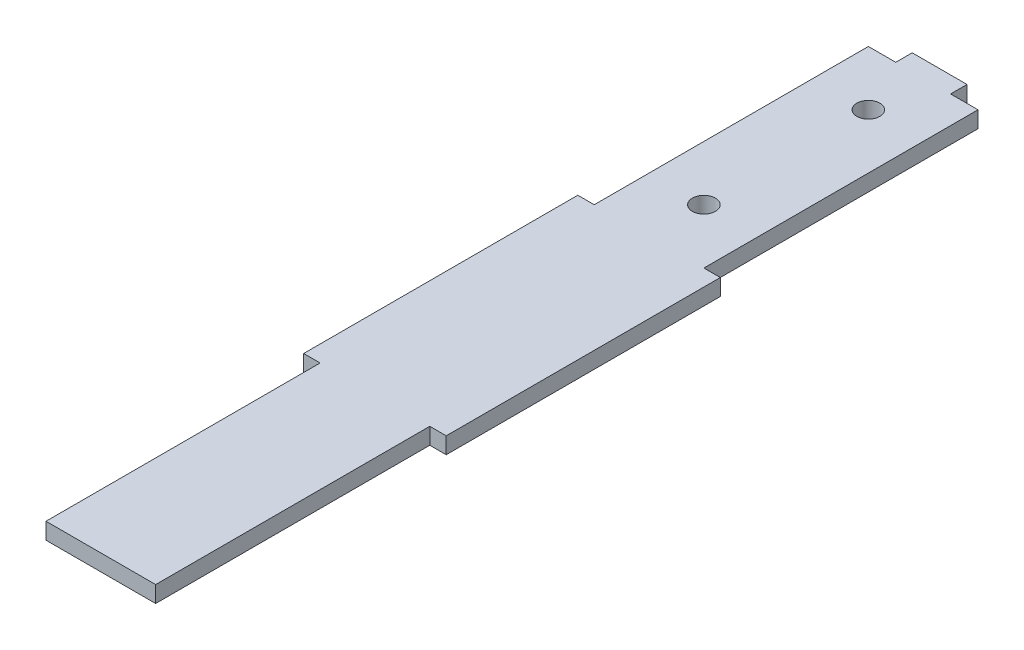
ISO-10303-21;
HEADER;
FILE_DESCRIPTION(('STEP AP214'),'2;1');
FILE_NAME('part.step','',(''),(''),'','','');
FILE_SCHEMA(('AUTOMOTIVE_DESIGN { 1 0 10303 214 1 1 1 1 }'));
ENDSEC;
DATA;
#1=APPLICATION_CONTEXT('core data for automotive mechanical design processes');
#2=APPLICATION_PROTOCOL_DEFINITION('international standard','automotive_design',2000,#1);
#3=PRODUCT_CONTEXT('',#1,'mechanical');
#4=PRODUCT('Part','Part','',(#3));
#5=PRODUCT_RELATED_PRODUCT_CATEGORY('part','',(#4));
#6=PRODUCT_DEFINITION_FORMATION('','',#4);
#7=PRODUCT_DEFINITION_CONTEXT('part definition',#1,'design');
#8=PRODUCT_DEFINITION('design','',#6,#7);
#9=PRODUCT_DEFINITION_SHAPE('','',#8);
#10=(LENGTH_UNIT() NAMED_UNIT(*) SI_UNIT(.MILLI.,.METRE.));
#11=(NAMED_UNIT(*) PLANE_ANGLE_UNIT() SI_UNIT($,.RADIAN.));
#12=(NAMED_UNIT(*) SI_UNIT($,.STERADIAN.) SOLID_ANGLE_UNIT());
#13=UNCERTAINTY_MEASURE_WITH_UNIT(LENGTH_MEASURE(1.E-05),#10,'distance_accuracy_value','');
#14=(GEOMETRIC_REPRESENTATION_CONTEXT(3) GLOBAL_UNCERTAINTY_ASSIGNED_CONTEXT((#13)) GLOBAL_UNIT_ASSIGNED_CONTEXT((#10,
#11,#12)) REPRESENTATION_CONTEXT('',''));
#15=CARTESIAN_POINT('',(0.,0.,0.));
#16=DIRECTION('',(0.,0.,1.));
#17=DIRECTION('',(1.,0.,0.));
#18=AXIS2_PLACEMENT_3D('',#15,#16,#17);
#19=CARTESIAN_POINT('',(0.,3.,0.));
#20=DIRECTION('',(1.,0.,0.));
#21=DIRECTION('',(0.,0.,-1.));
#22=AXIS2_PLACEMENT_3D('',#19,#20,#21);
#23=PLANE('',#22);
#24=DIRECTION('',(0.,0.,1.));
#25=VECTOR('',#24,1.);
#26=CARTESIAN_POINT('',(0.,0.,0.));
#27=LINE('',#26,#25);
#28=CARTESIAN_POINT('',(0.,0.,0.));
#29=VERTEX_POINT('',#28);
#30=CARTESIAN_POINT('',(0.,0.,50.));
#31=VERTEX_POINT('',#30);
#32=EDGE_CURVE('E179',#29,#31,#27,.T.);
#33=ORIENTED_EDGE('',*,*,#32,.T.);
#34=DIRECTION('',(0.,-1.,0.));
#35=VECTOR('',#34,1.);
#36=CARTESIAN_POINT('',(0.,3.,50.));
#37=LINE('',#36,#35);
#38=CARTESIAN_POINT('',(0.,3.,50.));
#39=VERTEX_POINT('',#38);
#40=EDGE_CURVE('E11',#39,#31,#37,.T.);
#41=ORIENTED_EDGE('',*,*,#40,.F.);
#42=DIRECTION('',(0.,0.,1.));
#43=VECTOR('',#42,1.);
#44=CARTESIAN_POINT('',(0.,3.,0.));
#45=LINE('',#44,#43);
#46=CARTESIAN_POINT('',(0.,3.,0.));
#47=VERTEX_POINT('',#46);
#48=EDGE_CURVE('E210',#47,#39,#45,.T.);
#49=ORIENTED_EDGE('',*,*,#48,.F.);
#50=DIRECTION('',(0.,-1.,0.));
#51=VECTOR('',#50,1.);
#52=CARTESIAN_POINT('',(0.,3.,0.));
#53=LINE('',#52,#51);
#54=EDGE_CURVE('E175',#47,#29,#53,.T.);
#55=ORIENTED_EDGE('',*,*,#54,.T.);
#56=EDGE_LOOP('',(#33,#41,#49,#55));
#57=FACE_BOUND('',#56,.T.);
#58=ADVANCED_FACE('F35',(#57),#23,.F.);
#59=CARTESIAN_POINT('',(0.,3.,50.));
#60=DIRECTION('',(0.,0.,1.));
#61=DIRECTION('',(1.,0.,0.));
#62=AXIS2_PLACEMENT_3D('',#59,#60,#61);
#63=PLANE('',#62);
#64=DIRECTION('',(-1.,0.,0.));
#65=VECTOR('',#64,1.);
#66=CARTESIAN_POINT('',(0.,0.,50.));
#67=LINE('',#66,#65);
#68=CARTESIAN_POINT('',(-3.,0.,50.));
#69=VERTEX_POINT('',#68);
#70=EDGE_CURVE('E182',#31,#69,#67,.T.);
#71=ORIENTED_EDGE('',*,*,#70,.T.);
#72=DIRECTION('',(0.,-1.,0.));
#73=VECTOR('',#72,1.);
#74=CARTESIAN_POINT('',(-3.,3.,50.));
#75=LINE('',#74,#73);
#76=CARTESIAN_POINT('',(-3.,3.,50.));
#77=VERTEX_POINT('',#76);
#78=EDGE_CURVE('E43',#77,#69,#75,.T.);
#79=ORIENTED_EDGE('',*,*,#78,.F.);
#80=DIRECTION('',(-1.,0.,0.));
#81=VECTOR('',#80,1.);
#82=CARTESIAN_POINT('',(0.,3.,50.));
#83=LINE('',#82,#81);
#84=EDGE_CURVE('E118',#39,#77,#83,.T.);
#85=ORIENTED_EDGE('',*,*,#84,.F.);
#86=ORIENTED_EDGE('',*,*,#40,.T.);
#87=EDGE_LOOP('',(#71,#79,#85,#86));
#88=FACE_BOUND('',#87,.T.);
#89=ADVANCED_FACE('F310',(#88),#63,.F.);
#90=CARTESIAN_POINT('',(-3.,3.,50.));
#91=DIRECTION('',(1.,0.,0.));
#92=DIRECTION('',(0.,0.,-1.));
#93=AXIS2_PLACEMENT_3D('',#90,#91,#92);
#94=PLANE('',#93);
#95=DIRECTION('',(0.,0.,1.));
#96=VECTOR('',#95,1.);
#97=CARTESIAN_POINT('',(-3.,0.,50.));
#98=LINE('',#97,#96);
#99=CARTESIAN_POINT('',(-2.99999999999999,0.,100.));
#100=VERTEX_POINT('',#99);
#101=EDGE_CURVE('E185',#69,#100,#98,.T.);
#102=ORIENTED_EDGE('',*,*,#101,.T.);
#103=DIRECTION('',(0.,-1.,0.));
#104=VECTOR('',#103,1.);
#105=CARTESIAN_POINT('',(-2.99999999999999,3.,100.));
#106=LINE('',#105,#104);
#107=CARTESIAN_POINT('',(-2.99999999999999,3.,100.));
#108=VERTEX_POINT('',#107);
#109=EDGE_CURVE('E241',#108,#100,#106,.T.);
#110=ORIENTED_EDGE('',*,*,#109,.F.);
#111=DIRECTION('',(0.,0.,1.));
#112=VECTOR('',#111,1.);
#113=CARTESIAN_POINT('',(-3.,3.,50.));
#114=LINE('',#113,#112);
#115=EDGE_CURVE('E249',#77,#108,#114,.T.);
#116=ORIENTED_EDGE('',*,*,#115,.F.);
#117=ORIENTED_EDGE('',*,*,#78,.T.);
#118=EDGE_LOOP('',(#102,#110,#116,#117));
#119=FACE_BOUND('',#118,.T.);
#120=ADVANCED_FACE('F247',(#119),#94,.F.);
#121=CARTESIAN_POINT('',(0.,3.,100.));
#122=DIRECTION('',(0.,0.,-1.));
#123=DIRECTION('',(-1.,0.,0.));
#124=AXIS2_PLACEMENT_3D('',#121,#122,#123);
#125=PLANE('',#124);
#126=DIRECTION('',(1.,0.,0.));
#127=VECTOR('',#126,1.);
#128=CARTESIAN_POINT('',(0.,0.,100.));
#129=LINE('',#128,#127);
#130=CARTESIAN_POINT('',(0.,0.,100.));
#131=VERTEX_POINT('',#130);
#132=EDGE_CURVE('E187',#100,#131,#129,.T.);
#133=ORIENTED_EDGE('',*,*,#132,.T.);
#134=DIRECTION('',(0.,-1.,0.));
#135=VECTOR('',#134,1.);
#136=CARTESIAN_POINT('',(0.,3.,100.));
#137=LINE('',#136,#135);
#138=CARTESIAN_POINT('',(0.,3.,100.));
#139=VERTEX_POINT('',#138);
#140=EDGE_CURVE('E238',#139,#131,#137,.T.);
#141=ORIENTED_EDGE('',*,*,#140,.F.);
#142=DIRECTION('',(1.,0.,0.));
#143=VECTOR('',#142,1.);
#144=CARTESIAN_POINT('',(0.,3.,100.));
#145=LINE('',#144,#143);
#146=EDGE_CURVE('E267',#108,#139,#145,.T.);
#147=ORIENTED_EDGE('',*,*,#146,.F.);
#148=ORIENTED_EDGE('',*,*,#109,.T.);
#149=EDGE_LOOP('',(#133,#141,#147,#148));
#150=FACE_BOUND('',#149,.T.);
#151=ADVANCED_FACE('F258',(#150),#125,.F.);
#152=CARTESIAN_POINT('',(0.,3.,100.));
#153=DIRECTION('',(1.,0.,0.));
#154=DIRECTION('',(0.,0.,-1.));
#155=AXIS2_PLACEMENT_3D('',#152,#153,#154);
#156=PLANE('',#155);
#157=DIRECTION('',(0.,0.,1.));
#158=VECTOR('',#157,1.);
#159=CARTESIAN_POINT('',(0.,0.,100.));
#160=LINE('',#159,#158);
#161=CARTESIAN_POINT('',(0.,0.,150.));
#162=VERTEX_POINT('',#161);
#163=EDGE_CURVE('E189',#131,#162,#160,.T.);
#164=ORIENTED_EDGE('',*,*,#163,.T.);
#165=DIRECTION('',(0.,-1.,0.));
#166=VECTOR('',#165,1.);
#167=CARTESIAN_POINT('',(0.,3.,150.));
#168=LINE('',#167,#166);
#169=CARTESIAN_POINT('',(0.,3.,150.));
#170=VERTEX_POINT('',#169);
#171=EDGE_CURVE('E235',#170,#162,#168,.T.);
#172=ORIENTED_EDGE('',*,*,#171,.F.);
#173=DIRECTION('',(0.,0.,1.));
#174=VECTOR('',#173,1.);
#175=CARTESIAN_POINT('',(0.,3.,100.));
#176=LINE('',#175,#174);
#177=EDGE_CURVE('E264',#139,#170,#176,.T.);
#178=ORIENTED_EDGE('',*,*,#177,.F.);
#179=ORIENTED_EDGE('',*,*,#140,.T.);
#180=EDGE_LOOP('',(#164,#172,#178,#179));
#181=FACE_BOUND('',#180,.T.);
#182=ADVANCED_FACE('F262',(#181),#156,.F.);
#183=CARTESIAN_POINT('',(0.,3.,150.));
#184=DIRECTION('',(0.,0.,-1.));
#185=DIRECTION('',(-1.,0.,0.));
#186=AXIS2_PLACEMENT_3D('',#183,#184,#185);
#187=PLANE('',#186);
#188=DIRECTION('',(1.,0.,0.));
#189=VECTOR('',#188,1.);
#190=CARTESIAN_POINT('',(0.,0.,150.));
#191=LINE('',#190,#189);
#192=CARTESIAN_POINT('',(20.,0.,150.));
#193=VERTEX_POINT('',#192);
#194=EDGE_CURVE('E191',#162,#193,#191,.T.);
#195=ORIENTED_EDGE('',*,*,#194,.T.);
#196=DIRECTION('',(0.,-1.,0.));
#197=VECTOR('',#196,1.);
#198=CARTESIAN_POINT('',(20.,3.,150.));
#199=LINE('',#198,#197);
#200=CARTESIAN_POINT('',(20.,3.,150.));
#201=VERTEX_POINT('',#200);
#202=EDGE_CURVE('E232',#201,#193,#199,.T.);
#203=ORIENTED_EDGE('',*,*,#202,.F.);
#204=DIRECTION('',(1.,0.,0.));
#205=VECTOR('',#204,1.);
#206=CARTESIAN_POINT('',(0.,3.,150.));
#207=LINE('',#206,#205);
#208=EDGE_CURVE('E266',#170,#201,#207,.T.);
#209=ORIENTED_EDGE('',*,*,#208,.F.);
#210=ORIENTED_EDGE('',*,*,#171,.T.);
#211=EDGE_LOOP('',(#195,#203,#209,#210));
#212=FACE_BOUND('',#211,.T.);
#213=ADVANCED_FACE('F323',(#212),#187,.F.);
#214=CARTESIAN_POINT('',(20.,3.,100.));
#215=DIRECTION('',(-1.,0.,0.));
#216=DIRECTION('',(0.,0.,1.));
#217=AXIS2_PLACEMENT_3D('',#214,#215,#216);
#218=PLANE('',#217);
#219=DIRECTION('',(0.,0.,-1.));
#220=VECTOR('',#219,1.);
#221=CARTESIAN_POINT('',(20.,0.,100.));
#222=LINE('',#221,#220);
#223=CARTESIAN_POINT('',(20.,0.,100.));
#224=VERTEX_POINT('',#223);
#225=EDGE_CURVE('E193',#193,#224,#222,.T.);
#226=ORIENTED_EDGE('',*,*,#225,.T.);
#227=DIRECTION('',(0.,-1.,0.));
#228=VECTOR('',#227,1.);
#229=CARTESIAN_POINT('',(20.,3.,100.));
#230=LINE('',#229,#228);
#231=CARTESIAN_POINT('',(20.,3.,100.));
#232=VERTEX_POINT('',#231);
#233=EDGE_CURVE('E229',#232,#224,#230,.T.);
#234=ORIENTED_EDGE('',*,*,#233,.F.);
#235=DIRECTION('',(0.,0.,-1.));
#236=VECTOR('',#235,1.);
#237=CARTESIAN_POINT('',(20.,3.,100.));
#238=LINE('',#237,#236);
#239=EDGE_CURVE('E269',#201,#232,#238,.T.);
#240=ORIENTED_EDGE('',*,*,#239,.F.);
#241=ORIENTED_EDGE('',*,*,#202,.T.);
#242=EDGE_LOOP('',(#226,#234,#240,#241));
#243=FACE_BOUND('',#242,.T.);
#244=ADVANCED_FACE('F326',(#243),#218,.F.);
#245=CARTESIAN_POINT('',(20.,3.,100.));
#246=DIRECTION('',(0.,0.,-1.));
#247=DIRECTION('',(-1.,0.,0.));
#248=AXIS2_PLACEMENT_3D('',#245,#246,#247);
#249=PLANE('',#248);
#250=DIRECTION('',(1.,0.,0.));
#251=VECTOR('',#250,1.);
#252=CARTESIAN_POINT('',(20.,0.,100.));
#253=LINE('',#252,#251);
#254=CARTESIAN_POINT('',(23.,0.,100.));
#255=VERTEX_POINT('',#254);
#256=EDGE_CURVE('E195',#224,#255,#253,.T.);
#257=ORIENTED_EDGE('',*,*,#256,.T.);
#258=DIRECTION('',(0.,-1.,0.));
#259=VECTOR('',#258,1.);
#260=CARTESIAN_POINT('',(23.,3.,100.));
#261=LINE('',#260,#259);
#262=CARTESIAN_POINT('',(23.,3.,100.));
#263=VERTEX_POINT('',#262);
#264=EDGE_CURVE('E226',#263,#255,#261,.T.);
#265=ORIENTED_EDGE('',*,*,#264,.F.);
#266=DIRECTION('',(1.,0.,0.));
#267=VECTOR('',#266,1.);
#268=CARTESIAN_POINT('',(20.,3.,100.));
#269=LINE('',#268,#267);
#270=EDGE_CURVE('E275',#232,#263,#269,.T.);
#271=ORIENTED_EDGE('',*,*,#270,.F.);
#272=ORIENTED_EDGE('',*,*,#233,.T.);
#273=EDGE_LOOP('',(#257,#265,#271,#272));
#274=FACE_BOUND('',#273,.T.);
#275=ADVANCED_FACE('F330',(#274),#249,.F.);
#276=CARTESIAN_POINT('',(23.,3.,50.));
#277=DIRECTION('',(-1.,0.,0.));
#278=DIRECTION('',(0.,0.,1.));
#279=AXIS2_PLACEMENT_3D('',#276,#277,#278);
#280=PLANE('',#279);
#281=DIRECTION('',(0.,0.,-1.));
#282=VECTOR('',#281,1.);
#283=CARTESIAN_POINT('',(23.,0.,50.));
#284=LINE('',#283,#282);
#285=CARTESIAN_POINT('',(23.,0.,50.));
#286=VERTEX_POINT('',#285);
#287=EDGE_CURVE('E197',#255,#286,#284,.T.);
#288=ORIENTED_EDGE('',*,*,#287,.T.);
#289=DIRECTION('',(0.,-1.,0.));
#290=VECTOR('',#289,1.);
#291=CARTESIAN_POINT('',(23.,3.,50.));
#292=LINE('',#291,#290);
#293=CARTESIAN_POINT('',(23.,3.,50.));
#294=VERTEX_POINT('',#293);
#295=EDGE_CURVE('E223',#294,#286,#292,.T.);
#296=ORIENTED_EDGE('',*,*,#295,.F.);
#297=DIRECTION('',(0.,0.,-1.));
#298=VECTOR('',#297,1.);
#299=CARTESIAN_POINT('',(23.,3.,50.));
#300=LINE('',#299,#298);
#301=EDGE_CURVE('E277',#263,#294,#300,.T.);
#302=ORIENTED_EDGE('',*,*,#301,.F.);
#303=ORIENTED_EDGE('',*,*,#264,.T.);
#304=EDGE_LOOP('',(#288,#296,#302,#303));
#305=FACE_BOUND('',#304,.T.);
#306=ADVANCED_FACE('F334',(#305),#280,.F.);
#307=CARTESIAN_POINT('',(20.,3.,50.));
#308=DIRECTION('',(0.,0.,1.));
#309=DIRECTION('',(1.,0.,0.));
#310=AXIS2_PLACEMENT_3D('',#307,#308,#309);
#311=PLANE('',#310);
#312=DIRECTION('',(-1.,0.,0.));
#313=VECTOR('',#312,1.);
#314=CARTESIAN_POINT('',(20.,0.,50.));
#315=LINE('',#314,#313);
#316=CARTESIAN_POINT('',(20.,0.,50.));
#317=VERTEX_POINT('',#316);
#318=EDGE_CURVE('E199',#286,#317,#315,.T.);
#319=ORIENTED_EDGE('',*,*,#318,.T.);
#320=DIRECTION('',(0.,-1.,0.));
#321=VECTOR('',#320,1.);
#322=CARTESIAN_POINT('',(20.,3.,50.));
#323=LINE('',#322,#321);
#324=CARTESIAN_POINT('',(20.,3.,50.));
#325=VERTEX_POINT('',#324);
#326=EDGE_CURVE('E220',#325,#317,#323,.T.);
#327=ORIENTED_EDGE('',*,*,#326,.F.);
#328=DIRECTION('',(-1.,0.,0.));
#329=VECTOR('',#328,1.);
#330=CARTESIAN_POINT('',(20.,3.,50.));
#331=LINE('',#330,#329);
#332=EDGE_CURVE('E279',#294,#325,#331,.T.);
#333=ORIENTED_EDGE('',*,*,#332,.F.);
#334=ORIENTED_EDGE('',*,*,#295,.T.);
#335=EDGE_LOOP('',(#319,#327,#333,#334));
#336=FACE_BOUND('',#335,.T.);
#337=ADVANCED_FACE('F338',(#336),#311,.F.);
#338=CARTESIAN_POINT('',(20.,3.,0.));
#339=DIRECTION('',(-1.,0.,0.));
#340=DIRECTION('',(0.,0.,1.));
#341=AXIS2_PLACEMENT_3D('',#338,#339,#340);
#342=PLANE('',#341);
#343=DIRECTION('',(0.,0.,-1.));
#344=VECTOR('',#343,1.);
#345=CARTESIAN_POINT('',(20.,0.,0.));
#346=LINE('',#345,#344);
#347=CARTESIAN_POINT('',(20.,0.,0.));
#348=VERTEX_POINT('',#347);
#349=EDGE_CURVE('E201',#317,#348,#346,.T.);
#350=ORIENTED_EDGE('',*,*,#349,.T.);
#351=DIRECTION('',(0.,-1.,0.));
#352=VECTOR('',#351,1.);
#353=CARTESIAN_POINT('',(20.,3.,0.));
#354=LINE('',#353,#352);
#355=CARTESIAN_POINT('',(20.,3.,0.));
#356=VERTEX_POINT('',#355);
#357=EDGE_CURVE('E217',#356,#348,#354,.T.);
#358=ORIENTED_EDGE('',*,*,#357,.F.);
#359=DIRECTION('',(0.,0.,-1.));
#360=VECTOR('',#359,1.);
#361=CARTESIAN_POINT('',(20.,3.,0.));
#362=LINE('',#361,#360);
#363=EDGE_CURVE('E281',#325,#356,#362,.T.);
#364=ORIENTED_EDGE('',*,*,#363,.F.);
#365=ORIENTED_EDGE('',*,*,#326,.T.);
#366=EDGE_LOOP('',(#350,#358,#364,#365));
#367=FACE_BOUND('',#366,.T.);
#368=ADVANCED_FACE('F342',(#367),#342,.F.);
#369=CARTESIAN_POINT('',(15.,3.,0.));
#370=DIRECTION('',(0.,0.,1.));
#371=DIRECTION('',(1.,0.,0.));
#372=AXIS2_PLACEMENT_3D('',#369,#370,#371);
#373=PLANE('',#372);
#374=DIRECTION('',(-1.,0.,0.));
#375=VECTOR('',#374,1.);
#376=CARTESIAN_POINT('',(15.,0.,0.));
#377=LINE('',#376,#375);
#378=CARTESIAN_POINT('',(15.,0.,0.));
#379=VERTEX_POINT('',#378);
#380=EDGE_CURVE('E203',#348,#379,#377,.T.);
#381=ORIENTED_EDGE('',*,*,#380,.T.);
#382=DIRECTION('',(0.,-1.,0.));
#383=VECTOR('',#382,1.);
#384=CARTESIAN_POINT('',(15.,3.,0.));
#385=LINE('',#384,#383);
#386=CARTESIAN_POINT('',(15.,3.,0.));
#387=VERTEX_POINT('',#386);
#388=EDGE_CURVE('E214',#387,#379,#385,.T.);
#389=ORIENTED_EDGE('',*,*,#388,.F.);
#390=DIRECTION('',(-1.,0.,0.));
#391=VECTOR('',#390,1.);
#392=CARTESIAN_POINT('',(15.,3.,0.));
#393=LINE('',#392,#391);
#394=EDGE_CURVE('E283',#356,#387,#393,.T.);
#395=ORIENTED_EDGE('',*,*,#394,.F.);
#396=ORIENTED_EDGE('',*,*,#357,.T.);
#397=EDGE_LOOP('',(#381,#389,#395,#396));
#398=FACE_BOUND('',#397,.T.);
#399=ADVANCED_FACE('F289',(#398),#373,.F.);
#400=CARTESIAN_POINT('',(15.,3.,-3.));
#401=DIRECTION('',(-1.,0.,0.));
#402=DIRECTION('',(0.,0.,1.));
#403=AXIS2_PLACEMENT_3D('',#400,#401,#402);
#404=PLANE('',#403);
#405=DIRECTION('',(0.,0.,-1.));
#406=VECTOR('',#405,1.);
#407=CARTESIAN_POINT('',(15.,0.,-3.));
#408=LINE('',#407,#406);
#409=CARTESIAN_POINT('',(15.,0.,-3.));
#410=VERTEX_POINT('',#409);
#411=EDGE_CURVE('E205',#379,#410,#408,.T.);
#412=ORIENTED_EDGE('',*,*,#411,.T.);
#413=DIRECTION('',(0.,-1.,0.));
#414=VECTOR('',#413,1.);
#415=CARTESIAN_POINT('',(15.,3.,-3.));
#416=LINE('',#415,#414);
#417=CARTESIAN_POINT('',(15.,3.,-3.));
#418=VERTEX_POINT('',#417);
#419=EDGE_CURVE('E170',#418,#410,#416,.T.);
#420=ORIENTED_EDGE('',*,*,#419,.F.);
#421=DIRECTION('',(0.,0.,-1.));
#422=VECTOR('',#421,1.);
#423=CARTESIAN_POINT('',(15.,3.,-3.));
#424=LINE('',#423,#422);
#425=EDGE_CURVE('E161',#387,#418,#424,.T.);
#426=ORIENTED_EDGE('',*,*,#425,.F.);
#427=ORIENTED_EDGE('',*,*,#388,.T.);
#428=EDGE_LOOP('',(#412,#420,#426,#427));
#429=FACE_BOUND('',#428,.T.);
#430=ADVANCED_FACE('F293',(#429),#404,.F.);
#431=CARTESIAN_POINT('',(5.,3.,-3.));
#432=DIRECTION('',(0.,0.,1.));
#433=DIRECTION('',(1.,0.,0.));
#434=AXIS2_PLACEMENT_3D('',#431,#432,#433);
#435=PLANE('',#434);
#436=DIRECTION('',(-1.,0.,0.));
#437=VECTOR('',#436,1.);
#438=CARTESIAN_POINT('',(5.,0.,-3.));
#439=LINE('',#438,#437);
#440=CARTESIAN_POINT('',(5.,0.,-3.));
#441=VERTEX_POINT('',#440);
#442=EDGE_CURVE('E169',#410,#441,#439,.T.);
#443=ORIENTED_EDGE('',*,*,#442,.T.);
#444=DIRECTION('',(0.,-1.,0.));
#445=VECTOR('',#444,1.);
#446=CARTESIAN_POINT('',(5.,3.,-3.));
#447=LINE('',#446,#445);
#448=CARTESIAN_POINT('',(5.,3.,-3.));
#449=VERTEX_POINT('',#448);
#450=EDGE_CURVE('E166',#449,#441,#447,.T.);
#451=ORIENTED_EDGE('',*,*,#450,.F.);
#452=DIRECTION('',(-1.,0.,0.));
#453=VECTOR('',#452,1.);
#454=CARTESIAN_POINT('',(5.,3.,-3.));
#455=LINE('',#454,#453);
#456=EDGE_CURVE('E155',#418,#449,#455,.T.);
#457=ORIENTED_EDGE('',*,*,#456,.F.);
#458=ORIENTED_EDGE('',*,*,#419,.T.);
#459=EDGE_LOOP('',(#443,#451,#457,#458));
#460=FACE_BOUND('',#459,.T.);
#461=ADVANCED_FACE('F167',(#460),#435,.F.);
#462=CARTESIAN_POINT('',(5.,3.,-3.));
#463=DIRECTION('',(1.,0.,0.));
#464=DIRECTION('',(0.,0.,-1.));
#465=AXIS2_PLACEMENT_3D('',#462,#463,#464);
#466=PLANE('',#465);
#467=DIRECTION('',(0.,0.,1.));
#468=VECTOR('',#467,1.);
#469=CARTESIAN_POINT('',(5.,0.,-3.));
#470=LINE('',#469,#468);
#471=CARTESIAN_POINT('',(5.,0.,0.));
#472=VERTEX_POINT('',#471);
#473=EDGE_CURVE('E104',#441,#472,#470,.T.);
#474=ORIENTED_EDGE('',*,*,#473,.T.);
#475=DIRECTION('',(0.,-1.,0.));
#476=VECTOR('',#475,1.);
#477=CARTESIAN_POINT('',(5.,3.,0.));
#478=LINE('',#477,#476);
#479=CARTESIAN_POINT('',(5.,3.,0.));
#480=VERTEX_POINT('',#479);
#481=EDGE_CURVE('E171',#480,#472,#478,.T.);
#482=ORIENTED_EDGE('',*,*,#481,.F.);
#483=DIRECTION('',(0.,0.,1.));
#484=VECTOR('',#483,1.);
#485=CARTESIAN_POINT('',(5.,3.,-3.));
#486=LINE('',#485,#484);
#487=EDGE_CURVE('E159',#449,#480,#486,.T.);
#488=ORIENTED_EDGE('',*,*,#487,.F.);
#489=ORIENTED_EDGE('',*,*,#450,.T.);
#490=EDGE_LOOP('',(#474,#482,#488,#489));
#491=FACE_BOUND('',#490,.T.);
#492=ADVANCED_FACE('F173',(#491),#466,.F.);
#493=CARTESIAN_POINT('',(0.,3.,0.));
#494=DIRECTION('',(0.,0.,1.));
#495=DIRECTION('',(1.,0.,0.));
#496=AXIS2_PLACEMENT_3D('',#493,#494,#495);
#497=PLANE('',#496);
#498=DIRECTION('',(-1.,0.,0.));
#499=VECTOR('',#498,1.);
#500=CARTESIAN_POINT('',(0.,0.,0.));
#501=LINE('',#500,#499);
#502=EDGE_CURVE('E110',#472,#29,#501,.T.);
#503=ORIENTED_EDGE('',*,*,#502,.T.);
#504=ORIENTED_EDGE('',*,*,#54,.F.);
#505=DIRECTION('',(-1.,0.,0.));
#506=VECTOR('',#505,1.);
#507=CARTESIAN_POINT('',(0.,3.,0.));
#508=LINE('',#507,#506);
#509=EDGE_CURVE('E51',#480,#47,#508,.T.);
#510=ORIENTED_EDGE('',*,*,#509,.F.);
#511=ORIENTED_EDGE('',*,*,#481,.T.);
#512=EDGE_LOOP('',(#503,#504,#510,#511));
#513=FACE_BOUND('',#512,.T.);
#514=ADVANCED_FACE('F297',(#513),#497,.F.);
#515=CARTESIAN_POINT('',(0.,3.,0.));
#516=DIRECTION('',(0.,-1.,0.));
#517=DIRECTION('',(0.,0.,-1.));
#518=AXIS2_PLACEMENT_3D('',#515,#516,#517);
#519=PLANE('',#518);
#520=CARTESIAN_POINT('',(10.,3.,10.));
#521=DIRECTION('',(0.,1.,0.));
#522=DIRECTION('',(0.,0.,1.));
#523=AXIS2_PLACEMENT_3D('',#520,#521,#522);
#524=CIRCLE('',#523,2.1);
#525=CARTESIAN_POINT('',(10.,3.,12.1));
#526=VERTEX_POINT('',#525);
#527=EDGE_CURVE('E402',#526,#526,#524,.T.);
#528=ORIENTED_EDGE('',*,*,#527,.F.);
#529=EDGE_LOOP('',(#528));
#530=FACE_BOUND('',#529,.T.);
#531=CARTESIAN_POINT('',(10.,3.,40.));
#532=DIRECTION('',(0.,1.,0.));
#533=DIRECTION('',(0.,0.,1.));
#534=AXIS2_PLACEMENT_3D('',#531,#532,#533);
#535=CIRCLE('',#534,2.1);
#536=CARTESIAN_POINT('',(10.,3.,42.1));
#537=VERTEX_POINT('',#536);
#538=EDGE_CURVE('E407',#537,#537,#535,.T.);
#539=ORIENTED_EDGE('',*,*,#538,.F.);
#540=EDGE_LOOP('',(#539));
#541=FACE_BOUND('',#540,.T.);
#542=ORIENTED_EDGE('',*,*,#48,.T.);
#543=ORIENTED_EDGE('',*,*,#84,.T.);
#544=ORIENTED_EDGE('',*,*,#115,.T.);
#545=ORIENTED_EDGE('',*,*,#146,.T.);
#546=ORIENTED_EDGE('',*,*,#177,.T.);
#547=ORIENTED_EDGE('',*,*,#208,.T.);
#548=ORIENTED_EDGE('',*,*,#239,.T.);
#549=ORIENTED_EDGE('',*,*,#270,.T.);
#550=ORIENTED_EDGE('',*,*,#301,.T.);
#551=ORIENTED_EDGE('',*,*,#332,.T.);
#552=ORIENTED_EDGE('',*,*,#363,.T.);
#553=ORIENTED_EDGE('',*,*,#394,.T.);
#554=ORIENTED_EDGE('',*,*,#425,.T.);
#555=ORIENTED_EDGE('',*,*,#456,.T.);
#556=ORIENTED_EDGE('',*,*,#487,.T.);
#557=ORIENTED_EDGE('',*,*,#509,.T.);
#558=EDGE_LOOP('',(#542,#543,#544,#545,#546,#547,#548,#549,#550,#551,#552,#553,#554,#555,#556,#557));
#559=FACE_BOUND('',#558,.T.);
#560=ADVANCED_FACE('F157',(#530,#541,#559),#519,.F.);
#561=CARTESIAN_POINT('',(0.,0.,0.));
#562=DIRECTION('',(0.,-1.,0.));
#563=DIRECTION('',(0.,0.,-1.));
#564=AXIS2_PLACEMENT_3D('',#561,#562,#563);
#565=PLANE('',#564);
#566=CARTESIAN_POINT('',(10.,0.,10.));
#567=DIRECTION('',(0.,1.,0.));
#568=DIRECTION('',(0.,0.,1.));
#569=AXIS2_PLACEMENT_3D('',#566,#567,#568);
#570=CIRCLE('',#569,2.1);
#571=CARTESIAN_POINT('',(10.,0.,12.1));
#572=VERTEX_POINT('',#571);
#573=EDGE_CURVE('E183',#572,#572,#570,.T.);
#574=ORIENTED_EDGE('',*,*,#573,.T.);
#575=EDGE_LOOP('',(#574));
#576=FACE_BOUND('',#575,.T.);
#577=CARTESIAN_POINT('',(10.,0.,40.));
#578=DIRECTION('',(0.,1.,0.));
#579=DIRECTION('',(0.,0.,1.));
#580=AXIS2_PLACEMENT_3D('',#577,#578,#579);
#581=CIRCLE('',#580,2.1);
#582=CARTESIAN_POINT('',(10.,0.,42.1));
#583=VERTEX_POINT('',#582);
#584=EDGE_CURVE('E403',#583,#583,#581,.T.);
#585=ORIENTED_EDGE('',*,*,#584,.T.);
#586=EDGE_LOOP('',(#585));
#587=FACE_BOUND('',#586,.T.);
#588=ORIENTED_EDGE('',*,*,#32,.F.);
#589=ORIENTED_EDGE('',*,*,#502,.F.);
#590=ORIENTED_EDGE('',*,*,#473,.F.);
#591=ORIENTED_EDGE('',*,*,#442,.F.);
#592=ORIENTED_EDGE('',*,*,#411,.F.);
#593=ORIENTED_EDGE('',*,*,#380,.F.);
#594=ORIENTED_EDGE('',*,*,#349,.F.);
#595=ORIENTED_EDGE('',*,*,#318,.F.);
#596=ORIENTED_EDGE('',*,*,#287,.F.);
#597=ORIENTED_EDGE('',*,*,#256,.F.);
#598=ORIENTED_EDGE('',*,*,#225,.F.);
#599=ORIENTED_EDGE('',*,*,#194,.F.);
#600=ORIENTED_EDGE('',*,*,#163,.F.);
#601=ORIENTED_EDGE('',*,*,#132,.F.);
#602=ORIENTED_EDGE('',*,*,#101,.F.);
#603=ORIENTED_EDGE('',*,*,#70,.F.);
#604=EDGE_LOOP('',(#588,#589,#590,#591,#592,#593,#594,#595,#596,#597,#598,#599,#600,#601,#602,#603));
#605=FACE_BOUND('',#604,.T.);
#606=ADVANCED_FACE('F253',(#576,#587,#605),#565,.T.);
#607=CARTESIAN_POINT('',(10.,0.,40.));
#608=DIRECTION('',(0.,1.,0.));
#609=DIRECTION('',(0.,0.,1.));
#610=AXIS2_PLACEMENT_3D('',#607,#608,#609);
#611=CYLINDRICAL_SURFACE('',#610,2.1);
#612=ORIENTED_EDGE('',*,*,#584,.F.);
#613=EDGE_LOOP('',(#612));
#614=FACE_BOUND('',#613,.T.);
#615=ORIENTED_EDGE('',*,*,#538,.T.);
#616=EDGE_LOOP('',(#615));
#617=FACE_BOUND('',#616,.T.);
#618=ADVANCED_FACE('F375',(#614,#617),#611,.F.);
#619=CARTESIAN_POINT('',(10.,0.,10.));
#620=DIRECTION('',(0.,1.,0.));
#621=DIRECTION('',(0.,0.,1.));
#622=AXIS2_PLACEMENT_3D('',#619,#620,#621);
#623=CYLINDRICAL_SURFACE('',#622,2.1);
#624=ORIENTED_EDGE('',*,*,#573,.F.);
#625=EDGE_LOOP('',(#624));
#626=FACE_BOUND('',#625,.T.);
#627=ORIENTED_EDGE('',*,*,#527,.T.);
#628=EDGE_LOOP('',(#627));
#629=FACE_BOUND('',#628,.T.);
#630=ADVANCED_FACE('F383',(#626,#629),#623,.F.);
#631=CLOSED_SHELL('',(#58,#89,#120,#151,#182,#213,#244,#275,#306,#337,#368,#399,#430,#461,#492,
#514,#560,#606,#618,#630));
#632=MANIFOLD_SOLID_BREP('B2',#631);
#633=ADVANCED_BREP_SHAPE_REPRESENTATION('',(#18,#632),#14);
#634=SHAPE_DEFINITION_REPRESENTATION(#9,#633);
ENDSEC;
END-ISO-10303-21;
